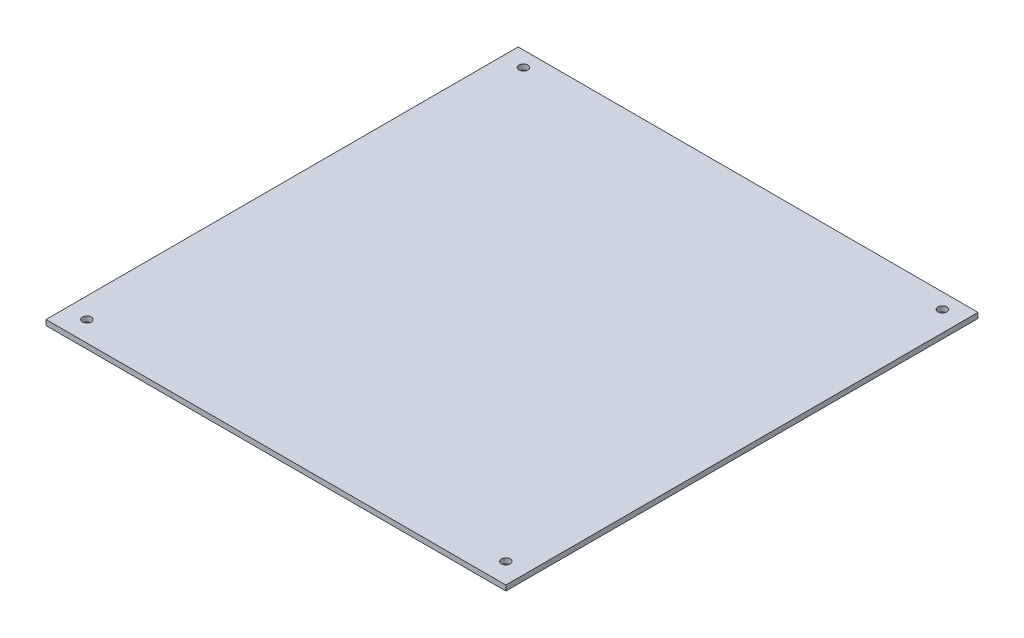
ISO-10303-21;
HEADER;
FILE_DESCRIPTION(('STEP AP214'),'2;1');
FILE_NAME('part.step','',(''),(''),'','','');
FILE_SCHEMA(('AUTOMOTIVE_DESIGN { 1 0 10303 214 1 1 1 1 }'));
ENDSEC;
DATA;
#1=APPLICATION_CONTEXT('core data for automotive mechanical design processes');
#2=APPLICATION_PROTOCOL_DEFINITION('international standard','automotive_design',2000,#1);
#3=PRODUCT_CONTEXT('',#1,'mechanical');
#4=PRODUCT('Part','Part','',(#3));
#5=PRODUCT_RELATED_PRODUCT_CATEGORY('part','',(#4));
#6=PRODUCT_DEFINITION_FORMATION('','',#4);
#7=PRODUCT_DEFINITION_CONTEXT('part definition',#1,'design');
#8=PRODUCT_DEFINITION('design','',#6,#7);
#9=PRODUCT_DEFINITION_SHAPE('','',#8);
#10=(LENGTH_UNIT() NAMED_UNIT(*) SI_UNIT(.MILLI.,.METRE.));
#11=(NAMED_UNIT(*) PLANE_ANGLE_UNIT() SI_UNIT($,.RADIAN.));
#12=(NAMED_UNIT(*) SI_UNIT($,.STERADIAN.) SOLID_ANGLE_UNIT());
#13=UNCERTAINTY_MEASURE_WITH_UNIT(LENGTH_MEASURE(1.E-05),#10,'distance_accuracy_value','');
#14=(GEOMETRIC_REPRESENTATION_CONTEXT(3) GLOBAL_UNCERTAINTY_ASSIGNED_CONTEXT((#13)) GLOBAL_UNIT_ASSIGNED_CONTEXT((#10,
#11,#12)) REPRESENTATION_CONTEXT('',''));
#15=CARTESIAN_POINT('',(0.,0.,0.));
#16=DIRECTION('',(0.,0.,1.));
#17=DIRECTION('',(1.,0.,0.));
#18=AXIS2_PLACEMENT_3D('',#15,#16,#17);
#19=CARTESIAN_POINT('',(0.,3.,0.));
#20=DIRECTION('',(0.,1.,0.));
#21=DIRECTION('',(0.,0.,1.));
#22=AXIS2_PLACEMENT_3D('',#19,#20,#21);
#23=PLANE('',#22);
#24=CARTESIAN_POINT('',(-119.34,3.,-125.84));
#25=DIRECTION('',(0.,1.,0.));
#26=DIRECTION('',(0.,0.,1.));
#27=AXIS2_PLACEMENT_3D('',#24,#25,#26);
#28=CIRCLE('',#27,2.5);
#29=CARTESIAN_POINT('',(-119.34,3.,-123.34));
#30=VERTEX_POINT('',#29);
#31=EDGE_CURVE('E120',#30,#30,#28,.T.);
#32=ORIENTED_EDGE('',*,*,#31,.F.);
#33=EDGE_LOOP('',(#32));
#34=FACE_BOUND('',#33,.T.);
#35=CARTESIAN_POINT('',(119.34,3.,122.84));
#36=DIRECTION('',(0.,1.,0.));
#37=DIRECTION('',(0.,0.,1.));
#38=AXIS2_PLACEMENT_3D('',#35,#36,#37);
#39=CIRCLE('',#38,2.5);
#40=CARTESIAN_POINT('',(119.34,3.,125.34));
#41=VERTEX_POINT('',#40);
#42=EDGE_CURVE('E99',#41,#41,#39,.T.);
#43=ORIENTED_EDGE('',*,*,#42,.F.);
#44=EDGE_LOOP('',(#43));
#45=FACE_BOUND('',#44,.T.);
#46=DIRECTION('',(0.,0.,1.));
#47=VECTOR('',#46,1.);
#48=CARTESIAN_POINT('',(-131.,3.,134.5));
#49=LINE('',#48,#47);
#50=CARTESIAN_POINT('',(-131.,3.,-134.5));
#51=VERTEX_POINT('',#50);
#52=CARTESIAN_POINT('',(-131.,3.,134.5));
#53=VERTEX_POINT('',#52);
#54=EDGE_CURVE('E84',#51,#53,#49,.T.);
#55=ORIENTED_EDGE('',*,*,#54,.T.);
#56=DIRECTION('',(1.,0.,0.));
#57=VECTOR('',#56,1.);
#58=CARTESIAN_POINT('',(131.,3.,134.5));
#59=LINE('',#58,#57);
#60=CARTESIAN_POINT('',(131.,3.,134.5));
#61=VERTEX_POINT('',#60);
#62=EDGE_CURVE('E79',#53,#61,#59,.T.);
#63=ORIENTED_EDGE('',*,*,#62,.T.);
#64=DIRECTION('',(0.,0.,-1.));
#65=VECTOR('',#64,1.);
#66=CARTESIAN_POINT('',(131.,3.,134.5));
#67=LINE('',#66,#65);
#68=CARTESIAN_POINT('',(131.,3.,-134.5));
#69=VERTEX_POINT('',#68);
#70=EDGE_CURVE('E82',#61,#69,#67,.T.);
#71=ORIENTED_EDGE('',*,*,#70,.T.);
#72=DIRECTION('',(-1.,0.,0.));
#73=VECTOR('',#72,1.);
#74=CARTESIAN_POINT('',(131.,3.,-134.5));
#75=LINE('',#74,#73);
#76=EDGE_CURVE('E49',#69,#51,#75,.T.);
#77=ORIENTED_EDGE('',*,*,#76,.T.);
#78=EDGE_LOOP('',(#55,#63,#71,#77));
#79=FACE_BOUND('',#78,.T.);
#80=CARTESIAN_POINT('',(-119.34,3.,122.84));
#81=DIRECTION('',(0.,1.,0.));
#82=DIRECTION('',(0.,0.,1.));
#83=AXIS2_PLACEMENT_3D('',#80,#81,#82);
#84=CIRCLE('',#83,2.5);
#85=CARTESIAN_POINT('',(-119.34,3.,125.34));
#86=VERTEX_POINT('',#85);
#87=EDGE_CURVE('E114',#86,#86,#84,.T.);
#88=ORIENTED_EDGE('',*,*,#87,.F.);
#89=EDGE_LOOP('',(#88));
#90=FACE_BOUND('',#89,.T.);
#91=CARTESIAN_POINT('',(119.34,3.,-125.84));
#92=DIRECTION('',(0.,1.,0.));
#93=DIRECTION('',(0.,0.,1.));
#94=AXIS2_PLACEMENT_3D('',#91,#92,#93);
#95=CIRCLE('',#94,2.5);
#96=CARTESIAN_POINT('',(119.34,3.,-123.34));
#97=VERTEX_POINT('',#96);
#98=EDGE_CURVE('E126',#97,#97,#95,.T.);
#99=ORIENTED_EDGE('',*,*,#98,.F.);
#100=EDGE_LOOP('',(#99));
#101=FACE_BOUND('',#100,.T.);
#102=ADVANCED_FACE('F32',(#34,#45,#79,#90,#101),#23,.T.);
#103=CARTESIAN_POINT('',(0.,0.,0.));
#104=DIRECTION('',(0.,1.,0.));
#105=DIRECTION('',(0.,0.,1.));
#106=AXIS2_PLACEMENT_3D('',#103,#104,#105);
#107=PLANE('',#106);
#108=DIRECTION('',(0.,0.,1.));
#109=VECTOR('',#108,1.);
#110=CARTESIAN_POINT('',(-131.,0.,134.5));
#111=LINE('',#110,#109);
#112=CARTESIAN_POINT('',(-131.,0.,-134.5));
#113=VERTEX_POINT('',#112);
#114=CARTESIAN_POINT('',(-131.,0.,134.5));
#115=VERTEX_POINT('',#114);
#116=EDGE_CURVE('E96',#113,#115,#111,.T.);
#117=ORIENTED_EDGE('',*,*,#116,.F.);
#118=DIRECTION('',(-1.,0.,0.));
#119=VECTOR('',#118,1.);
#120=CARTESIAN_POINT('',(131.,0.,-134.5));
#121=LINE('',#120,#119);
#122=CARTESIAN_POINT('',(131.,0.,-134.5));
#123=VERTEX_POINT('',#122);
#124=EDGE_CURVE('E72',#123,#113,#121,.T.);
#125=ORIENTED_EDGE('',*,*,#124,.F.);
#126=DIRECTION('',(0.,0.,-1.));
#127=VECTOR('',#126,1.);
#128=CARTESIAN_POINT('',(131.,0.,134.5));
#129=LINE('',#128,#127);
#130=CARTESIAN_POINT('',(131.,0.,134.5));
#131=VERTEX_POINT('',#130);
#132=EDGE_CURVE('E66',#131,#123,#129,.T.);
#133=ORIENTED_EDGE('',*,*,#132,.F.);
#134=DIRECTION('',(1.,0.,0.));
#135=VECTOR('',#134,1.);
#136=CARTESIAN_POINT('',(131.,0.,134.5));
#137=LINE('',#136,#135);
#138=EDGE_CURVE('E88',#115,#131,#137,.T.);
#139=ORIENTED_EDGE('',*,*,#138,.F.);
#140=EDGE_LOOP('',(#117,#125,#133,#139));
#141=FACE_BOUND('',#140,.T.);
#142=CARTESIAN_POINT('',(119.34,0.,122.84));
#143=DIRECTION('',(0.,1.,0.));
#144=DIRECTION('',(0.,0.,1.));
#145=AXIS2_PLACEMENT_3D('',#142,#143,#144);
#146=CIRCLE('',#145,2.5);
#147=CARTESIAN_POINT('',(119.34,0.,125.34));
#148=VERTEX_POINT('',#147);
#149=EDGE_CURVE('E111',#148,#148,#146,.T.);
#150=ORIENTED_EDGE('',*,*,#149,.T.);
#151=EDGE_LOOP('',(#150));
#152=FACE_BOUND('',#151,.T.);
#153=CARTESIAN_POINT('',(-119.34,0.,122.84));
#154=DIRECTION('',(0.,1.,0.));
#155=DIRECTION('',(0.,0.,1.));
#156=AXIS2_PLACEMENT_3D('',#153,#154,#155);
#157=CIRCLE('',#156,2.5);
#158=CARTESIAN_POINT('',(-119.34,0.,125.34));
#159=VERTEX_POINT('',#158);
#160=EDGE_CURVE('E117',#159,#159,#157,.T.);
#161=ORIENTED_EDGE('',*,*,#160,.T.);
#162=EDGE_LOOP('',(#161));
#163=FACE_BOUND('',#162,.T.);
#164=CARTESIAN_POINT('',(-119.34,0.,-125.84));
#165=DIRECTION('',(0.,1.,0.));
#166=DIRECTION('',(0.,0.,1.));
#167=AXIS2_PLACEMENT_3D('',#164,#165,#166);
#168=CIRCLE('',#167,2.5);
#169=CARTESIAN_POINT('',(-119.34,0.,-123.34));
#170=VERTEX_POINT('',#169);
#171=EDGE_CURVE('E123',#170,#170,#168,.T.);
#172=ORIENTED_EDGE('',*,*,#171,.T.);
#173=EDGE_LOOP('',(#172));
#174=FACE_BOUND('',#173,.T.);
#175=CARTESIAN_POINT('',(119.34,0.,-125.84));
#176=DIRECTION('',(0.,1.,0.));
#177=DIRECTION('',(0.,0.,1.));
#178=AXIS2_PLACEMENT_3D('',#175,#176,#177);
#179=CIRCLE('',#178,2.5);
#180=CARTESIAN_POINT('',(119.34,0.,-123.34));
#181=VERTEX_POINT('',#180);
#182=EDGE_CURVE('E129',#181,#181,#179,.T.);
#183=ORIENTED_EDGE('',*,*,#182,.T.);
#184=EDGE_LOOP('',(#183));
#185=FACE_BOUND('',#184,.T.);
#186=ADVANCED_FACE('F107',(#141,#152,#163,#174,#185),#107,.F.);
#187=CARTESIAN_POINT('',(-131.,3.,134.5));
#188=DIRECTION('',(1.,0.,0.));
#189=DIRECTION('',(0.,0.,-1.));
#190=AXIS2_PLACEMENT_3D('',#187,#188,#189);
#191=PLANE('',#190);
#192=ORIENTED_EDGE('',*,*,#116,.T.);
#193=DIRECTION('',(0.,-1.,0.));
#194=VECTOR('',#193,1.);
#195=CARTESIAN_POINT('',(-131.,3.,134.5));
#196=LINE('',#195,#194);
#197=EDGE_CURVE('E11',#53,#115,#196,.T.);
#198=ORIENTED_EDGE('',*,*,#197,.F.);
#199=ORIENTED_EDGE('',*,*,#54,.F.);
#200=DIRECTION('',(0.,-1.,0.));
#201=VECTOR('',#200,1.);
#202=CARTESIAN_POINT('',(-131.,3.,-134.5));
#203=LINE('',#202,#201);
#204=EDGE_CURVE('E92',#51,#113,#203,.T.);
#205=ORIENTED_EDGE('',*,*,#204,.T.);
#206=EDGE_LOOP('',(#192,#198,#199,#205));
#207=FACE_BOUND('',#206,.T.);
#208=ADVANCED_FACE('F34',(#207),#191,.F.);
#209=CARTESIAN_POINT('',(131.,3.,134.5));
#210=DIRECTION('',(0.,0.,-1.));
#211=DIRECTION('',(-1.,0.,0.));
#212=AXIS2_PLACEMENT_3D('',#209,#210,#211);
#213=PLANE('',#212);
#214=ORIENTED_EDGE('',*,*,#138,.T.);
#215=DIRECTION('',(0.,-1.,0.));
#216=VECTOR('',#215,1.);
#217=CARTESIAN_POINT('',(131.,3.,134.5));
#218=LINE('',#217,#216);
#219=EDGE_CURVE('E41',#61,#131,#218,.T.);
#220=ORIENTED_EDGE('',*,*,#219,.F.);
#221=ORIENTED_EDGE('',*,*,#62,.F.);
#222=ORIENTED_EDGE('',*,*,#197,.T.);
#223=EDGE_LOOP('',(#214,#220,#221,#222));
#224=FACE_BOUND('',#223,.T.);
#225=ADVANCED_FACE('F87',(#224),#213,.F.);
#226=CARTESIAN_POINT('',(131.,3.,134.5));
#227=DIRECTION('',(-1.,0.,0.));
#228=DIRECTION('',(0.,0.,1.));
#229=AXIS2_PLACEMENT_3D('',#226,#227,#228);
#230=PLANE('',#229);
#231=ORIENTED_EDGE('',*,*,#132,.T.);
#232=DIRECTION('',(0.,-1.,0.));
#233=VECTOR('',#232,1.);
#234=CARTESIAN_POINT('',(131.,3.,-134.5));
#235=LINE('',#234,#233);
#236=EDGE_CURVE('E89',#69,#123,#235,.T.);
#237=ORIENTED_EDGE('',*,*,#236,.F.);
#238=ORIENTED_EDGE('',*,*,#70,.F.);
#239=ORIENTED_EDGE('',*,*,#219,.T.);
#240=EDGE_LOOP('',(#231,#237,#238,#239));
#241=FACE_BOUND('',#240,.T.);
#242=ADVANCED_FACE('F90',(#241),#230,.F.);
#243=CARTESIAN_POINT('',(131.,3.,-134.5));
#244=DIRECTION('',(0.,0.,1.));
#245=DIRECTION('',(1.,0.,0.));
#246=AXIS2_PLACEMENT_3D('',#243,#244,#245);
#247=PLANE('',#246);
#248=ORIENTED_EDGE('',*,*,#124,.T.);
#249=ORIENTED_EDGE('',*,*,#204,.F.);
#250=ORIENTED_EDGE('',*,*,#76,.F.);
#251=ORIENTED_EDGE('',*,*,#236,.T.);
#252=EDGE_LOOP('',(#248,#249,#250,#251));
#253=FACE_BOUND('',#252,.T.);
#254=ADVANCED_FACE('F104',(#253),#247,.F.);
#255=CARTESIAN_POINT('',(119.34,3.,122.84));
#256=DIRECTION('',(0.,-1.,0.));
#257=DIRECTION('',(0.,0.,-1.));
#258=AXIS2_PLACEMENT_3D('',#255,#256,#257);
#259=CYLINDRICAL_SURFACE('',#258,2.5);
#260=ORIENTED_EDGE('',*,*,#42,.T.);
#261=EDGE_LOOP('',(#260));
#262=FACE_BOUND('',#261,.T.);
#263=ORIENTED_EDGE('',*,*,#149,.F.);
#264=EDGE_LOOP('',(#263));
#265=FACE_BOUND('',#264,.T.);
#266=ADVANCED_FACE('F148',(#262,#265),#259,.F.);
#267=CARTESIAN_POINT('',(-119.34,3.,122.84));
#268=DIRECTION('',(0.,-1.,0.));
#269=DIRECTION('',(0.,0.,-1.));
#270=AXIS2_PLACEMENT_3D('',#267,#268,#269);
#271=CYLINDRICAL_SURFACE('',#270,2.5);
#272=ORIENTED_EDGE('',*,*,#87,.T.);
#273=EDGE_LOOP('',(#272));
#274=FACE_BOUND('',#273,.T.);
#275=ORIENTED_EDGE('',*,*,#160,.F.);
#276=EDGE_LOOP('',(#275));
#277=FACE_BOUND('',#276,.T.);
#278=ADVANCED_FACE('F194',(#274,#277),#271,.F.);
#279=CARTESIAN_POINT('',(-119.34,3.,-125.84));
#280=DIRECTION('',(0.,-1.,0.));
#281=DIRECTION('',(0.,0.,-1.));
#282=AXIS2_PLACEMENT_3D('',#279,#280,#281);
#283=CYLINDRICAL_SURFACE('',#282,2.5);
#284=ORIENTED_EDGE('',*,*,#31,.T.);
#285=EDGE_LOOP('',(#284));
#286=FACE_BOUND('',#285,.T.);
#287=ORIENTED_EDGE('',*,*,#171,.F.);
#288=EDGE_LOOP('',(#287));
#289=FACE_BOUND('',#288,.T.);
#290=ADVANCED_FACE('F202',(#286,#289),#283,.F.);
#291=CARTESIAN_POINT('',(119.34,3.,-125.84));
#292=DIRECTION('',(0.,-1.,0.));
#293=DIRECTION('',(0.,0.,-1.));
#294=AXIS2_PLACEMENT_3D('',#291,#292,#293);
#295=CYLINDRICAL_SURFACE('',#294,2.5);
#296=ORIENTED_EDGE('',*,*,#98,.T.);
#297=EDGE_LOOP('',(#296));
#298=FACE_BOUND('',#297,.T.);
#299=ORIENTED_EDGE('',*,*,#182,.F.);
#300=EDGE_LOOP('',(#299));
#301=FACE_BOUND('',#300,.T.);
#302=ADVANCED_FACE('F135',(#298,#301),#295,.F.);
#303=CLOSED_SHELL('',(#102,#186,#208,#225,#242,#254,#266,#278,#290,#302));
#304=MANIFOLD_SOLID_BREP('B2',#303);
#305=ADVANCED_BREP_SHAPE_REPRESENTATION('',(#18,#304),#14);
#306=SHAPE_DEFINITION_REPRESENTATION(#9,#305);
ENDSEC;
END-ISO-10303-21;
